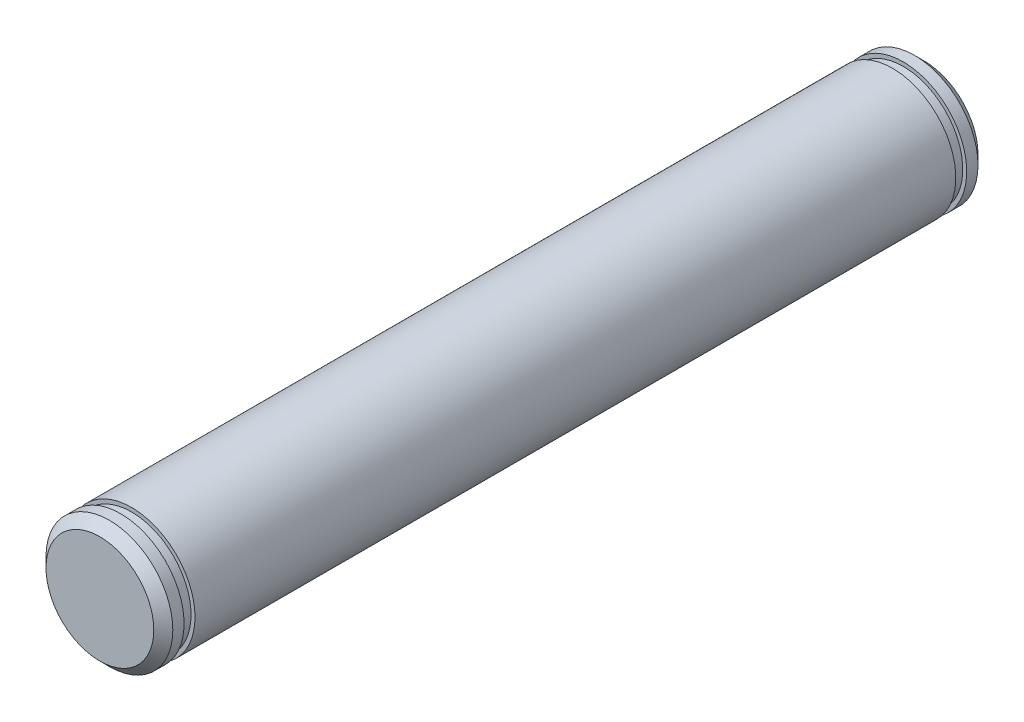
ISO-10303-21;
HEADER;
FILE_DESCRIPTION(('STEP AP214'),'2;1');
FILE_NAME('part.step','',(''),(''),'','','');
FILE_SCHEMA(('AUTOMOTIVE_DESIGN { 1 0 10303 214 1 1 1 1 }'));
ENDSEC;
DATA;
#1=APPLICATION_CONTEXT('core data for automotive mechanical design processes');
#2=APPLICATION_PROTOCOL_DEFINITION('international standard','automotive_design',2000,#1);
#3=PRODUCT_CONTEXT('',#1,'mechanical');
#4=PRODUCT('Part','Part','',(#3));
#5=PRODUCT_RELATED_PRODUCT_CATEGORY('part','',(#4));
#6=PRODUCT_DEFINITION_FORMATION('','',#4);
#7=PRODUCT_DEFINITION_CONTEXT('part definition',#1,'design');
#8=PRODUCT_DEFINITION('design','',#6,#7);
#9=PRODUCT_DEFINITION_SHAPE('','',#8);
#10=(LENGTH_UNIT() NAMED_UNIT(*) SI_UNIT(.MILLI.,.METRE.));
#11=(NAMED_UNIT(*) PLANE_ANGLE_UNIT() SI_UNIT($,.RADIAN.));
#12=(NAMED_UNIT(*) SI_UNIT($,.STERADIAN.) SOLID_ANGLE_UNIT());
#13=UNCERTAINTY_MEASURE_WITH_UNIT(LENGTH_MEASURE(1.E-05),#10,'distance_accuracy_value','');
#14=(GEOMETRIC_REPRESENTATION_CONTEXT(3) GLOBAL_UNCERTAINTY_ASSIGNED_CONTEXT((#13)) GLOBAL_UNIT_ASSIGNED_CONTEXT((#10,
#11,#12)) REPRESENTATION_CONTEXT('',''));
#15=CARTESIAN_POINT('',(0.,0.,0.));
#16=DIRECTION('',(0.,0.,1.));
#17=DIRECTION('',(1.,0.,0.));
#18=AXIS2_PLACEMENT_3D('',#15,#16,#17);
#19=CARTESIAN_POINT('',(0.,0.,165.1));
#20=DIRECTION('',(0.,0.,-1.));
#21=DIRECTION('',(-1.,0.,0.));
#22=AXIS2_PLACEMENT_3D('',#19,#20,#21);
#23=CYLINDRICAL_SURFACE('',#22,12.7);
#24=CARTESIAN_POINT('',(0.,0.,158.75));
#25=DIRECTION('',(0.,0.,-1.));
#26=DIRECTION('',(-1.,0.,0.));
#27=AXIS2_PLACEMENT_3D('',#24,#25,#26);
#28=CIRCLE('',#27,12.7);
#29=CARTESIAN_POINT('',(-12.7,0.,158.75));
#30=VERTEX_POINT('',#29);
#31=EDGE_CURVE('E74',#30,#30,#28,.T.);
#32=ORIENTED_EDGE('',*,*,#31,.T.);
#33=EDGE_LOOP('',(#32));
#34=FACE_BOUND('',#33,.T.);
#35=CARTESIAN_POINT('',(0.,0.,6.35));
#36=DIRECTION('',(0.,0.,-1.));
#37=DIRECTION('',(-1.,0.,0.));
#38=AXIS2_PLACEMENT_3D('',#35,#36,#37);
#39=CIRCLE('',#38,12.7);
#40=CARTESIAN_POINT('',(-12.7,0.,6.35));
#41=VERTEX_POINT('',#40);
#42=EDGE_CURVE('E53',#41,#41,#39,.T.);
#43=ORIENTED_EDGE('',*,*,#42,.F.);
#44=EDGE_LOOP('',(#43));
#45=FACE_BOUND('',#44,.T.);
#46=ADVANCED_FACE('F33',(#34,#45),#23,.T.);
#47=CARTESIAN_POINT('',(-12.7,0.,6.35));
#48=DIRECTION('',(0.,0.,1.));
#49=DIRECTION('',(1.,0.,0.));
#50=AXIS2_PLACEMENT_3D('',#47,#48,#49);
#51=PLANE('',#50);
#52=CARTESIAN_POINT('',(0.,0.,6.35));
#53=DIRECTION('',(0.,0.,-1.));
#54=DIRECTION('',(-1.,0.,0.));
#55=AXIS2_PLACEMENT_3D('',#52,#53,#54);
#56=CIRCLE('',#55,11.9126);
#57=CARTESIAN_POINT('',(-11.9126,0.,6.35));
#58=VERTEX_POINT('',#57);
#59=EDGE_CURVE('E56',#58,#58,#56,.T.);
#60=ORIENTED_EDGE('',*,*,#59,.F.);
#61=EDGE_LOOP('',(#60));
#62=FACE_BOUND('',#61,.T.);
#63=ORIENTED_EDGE('',*,*,#42,.T.);
#64=EDGE_LOOP('',(#63));
#65=FACE_BOUND('',#64,.T.);
#66=ADVANCED_FACE('F114',(#62,#65),#51,.F.);
#67=CARTESIAN_POINT('',(0.,0.,0.));
#68=DIRECTION('',(0.,0.,-1.));
#69=DIRECTION('',(-1.,0.,0.));
#70=AXIS2_PLACEMENT_3D('',#67,#68,#69);
#71=CYLINDRICAL_SURFACE('',#70,11.9126);
#72=CARTESIAN_POINT('',(0.,0.,4.1656));
#73=DIRECTION('',(0.,0.,-1.));
#74=DIRECTION('',(-1.,0.,0.));
#75=AXIS2_PLACEMENT_3D('',#72,#73,#74);
#76=CIRCLE('',#75,11.9126);
#77=CARTESIAN_POINT('',(-11.9126,0.,4.1656));
#78=VERTEX_POINT('',#77);
#79=EDGE_CURVE('E59',#78,#78,#76,.T.);
#80=ORIENTED_EDGE('',*,*,#79,.F.);
#81=EDGE_LOOP('',(#80));
#82=FACE_BOUND('',#81,.T.);
#83=ORIENTED_EDGE('',*,*,#59,.T.);
#84=EDGE_LOOP('',(#83));
#85=FACE_BOUND('',#84,.T.);
#86=ADVANCED_FACE('F126',(#82,#85),#71,.T.);
#87=CARTESIAN_POINT('',(-12.7,0.,4.1656));
#88=DIRECTION('',(0.,0.,-1.));
#89=DIRECTION('',(-1.,0.,0.));
#90=AXIS2_PLACEMENT_3D('',#87,#88,#89);
#91=PLANE('',#90);
#92=CARTESIAN_POINT('',(0.,0.,4.1656));
#93=DIRECTION('',(0.,0.,-1.));
#94=DIRECTION('',(-1.,0.,0.));
#95=AXIS2_PLACEMENT_3D('',#92,#93,#94);
#96=CIRCLE('',#95,12.7);
#97=CARTESIAN_POINT('',(-12.7,0.,4.1656));
#98=VERTEX_POINT('',#97);
#99=EDGE_CURVE('E62',#98,#98,#96,.T.);
#100=ORIENTED_EDGE('',*,*,#99,.F.);
#101=EDGE_LOOP('',(#100));
#102=FACE_BOUND('',#101,.T.);
#103=ORIENTED_EDGE('',*,*,#79,.T.);
#104=EDGE_LOOP('',(#103));
#105=FACE_BOUND('',#104,.T.);
#106=ADVANCED_FACE('F120',(#102,#105),#91,.F.);
#107=CARTESIAN_POINT('',(0.,0.,0.));
#108=DIRECTION('',(0.,0.,1.));
#109=DIRECTION('',(1.,0.,0.));
#110=AXIS2_PLACEMENT_3D('',#107,#108,#109);
#111=PLANE('',#110);
#112=CARTESIAN_POINT('',(0.,0.,0.));
#113=DIRECTION('',(0.,0.,1.));
#114=DIRECTION('',(1.,0.,0.));
#115=AXIS2_PLACEMENT_3D('',#112,#113,#114);
#116=CIRCLE('',#115,10.795);
#117=CARTESIAN_POINT('',(10.795,0.,0.));
#118=VERTEX_POINT('',#117);
#119=EDGE_CURVE('E10',#118,#118,#116,.F.);
#120=ORIENTED_EDGE('',*,*,#119,.T.);
#121=EDGE_LOOP('',(#120));
#122=FACE_BOUND('',#121,.T.);
#123=ADVANCED_FACE('F116',(#122),#111,.F.);
#124=CARTESIAN_POINT('',(0.,0.,1.90500000000002));
#125=DIRECTION('',(0.,0.,1.));
#126=DIRECTION('',(1.,0.,0.));
#127=AXIS2_PLACEMENT_3D('',#124,#125,#126);
#128=CIRCLE('',#127,12.7);
#129=CARTESIAN_POINT('',(12.7,0.,1.90500000000002));
#130=VERTEX_POINT('',#129);
#131=EDGE_CURVE('E40',#130,#130,#128,.T.);
#132=ORIENTED_EDGE('',*,*,#131,.T.);
#133=EDGE_LOOP('',(#132));
#134=FACE_BOUND('',#133,.T.);
#135=ORIENTED_EDGE('',*,*,#99,.T.);
#136=EDGE_LOOP('',(#135));
#137=FACE_BOUND('',#136,.T.);
#138=ADVANCED_FACE('F96',(#134,#137),#23,.T.);
#139=CARTESIAN_POINT('',(-12.7,0.,160.9344));
#140=DIRECTION('',(0.,0.,1.));
#141=DIRECTION('',(1.,0.,0.));
#142=AXIS2_PLACEMENT_3D('',#139,#140,#141);
#143=PLANE('',#142);
#144=CARTESIAN_POINT('',(0.,0.,160.9344));
#145=DIRECTION('',(0.,0.,-1.));
#146=DIRECTION('',(-1.,0.,0.));
#147=AXIS2_PLACEMENT_3D('',#144,#145,#146);
#148=CIRCLE('',#147,11.9126);
#149=CARTESIAN_POINT('',(-11.9126,0.,160.9344));
#150=VERTEX_POINT('',#149);
#151=EDGE_CURVE('E68',#150,#150,#148,.T.);
#152=ORIENTED_EDGE('',*,*,#151,.F.);
#153=EDGE_LOOP('',(#152));
#154=FACE_BOUND('',#153,.T.);
#155=CARTESIAN_POINT('',(0.,0.,160.9344));
#156=DIRECTION('',(0.,0.,-1.));
#157=DIRECTION('',(-1.,0.,0.));
#158=AXIS2_PLACEMENT_3D('',#155,#156,#157);
#159=CIRCLE('',#158,12.7);
#160=CARTESIAN_POINT('',(-12.7,0.,160.9344));
#161=VERTEX_POINT('',#160);
#162=EDGE_CURVE('E65',#161,#161,#159,.T.);
#163=ORIENTED_EDGE('',*,*,#162,.T.);
#164=EDGE_LOOP('',(#163));
#165=FACE_BOUND('',#164,.T.);
#166=ADVANCED_FACE('F90',(#154,#165),#143,.F.);
#167=CARTESIAN_POINT('',(0.,0.,0.));
#168=DIRECTION('',(0.,0.,-1.));
#169=DIRECTION('',(-1.,0.,0.));
#170=AXIS2_PLACEMENT_3D('',#167,#168,#169);
#171=CYLINDRICAL_SURFACE('',#170,11.9126);
#172=CARTESIAN_POINT('',(0.,0.,158.75));
#173=DIRECTION('',(0.,0.,-1.));
#174=DIRECTION('',(-1.,0.,0.));
#175=AXIS2_PLACEMENT_3D('',#172,#173,#174);
#176=CIRCLE('',#175,11.9126);
#177=CARTESIAN_POINT('',(-11.9126,0.,158.75));
#178=VERTEX_POINT('',#177);
#179=EDGE_CURVE('E71',#178,#178,#176,.T.);
#180=ORIENTED_EDGE('',*,*,#179,.F.);
#181=EDGE_LOOP('',(#180));
#182=FACE_BOUND('',#181,.T.);
#183=ORIENTED_EDGE('',*,*,#151,.T.);
#184=EDGE_LOOP('',(#183));
#185=FACE_BOUND('',#184,.T.);
#186=ADVANCED_FACE('F84',(#182,#185),#171,.T.);
#187=CARTESIAN_POINT('',(-12.7,0.,158.75));
#188=DIRECTION('',(0.,0.,-1.));
#189=DIRECTION('',(-1.,0.,0.));
#190=AXIS2_PLACEMENT_3D('',#187,#188,#189);
#191=PLANE('',#190);
#192=ORIENTED_EDGE('',*,*,#31,.F.);
#193=EDGE_LOOP('',(#192));
#194=FACE_BOUND('',#193,.T.);
#195=ORIENTED_EDGE('',*,*,#179,.T.);
#196=EDGE_LOOP('',(#195));
#197=FACE_BOUND('',#196,.T.);
#198=ADVANCED_FACE('F80',(#194,#197),#191,.F.);
#199=CARTESIAN_POINT('',(0.,0.,165.1));
#200=DIRECTION('',(0.,0.,1.));
#201=DIRECTION('',(1.,0.,0.));
#202=AXIS2_PLACEMENT_3D('',#199,#200,#201);
#203=PLANE('',#202);
#204=CARTESIAN_POINT('',(0.,0.,165.1));
#205=DIRECTION('',(0.,0.,1.));
#206=DIRECTION('',(1.,0.,0.));
#207=AXIS2_PLACEMENT_3D('',#204,#205,#206);
#208=CIRCLE('',#207,10.795);
#209=CARTESIAN_POINT('',(10.795,0.,165.1));
#210=VERTEX_POINT('',#209);
#211=EDGE_CURVE('E48',#210,#210,#208,.T.);
#212=ORIENTED_EDGE('',*,*,#211,.T.);
#213=EDGE_LOOP('',(#212));
#214=FACE_BOUND('',#213,.T.);
#215=ADVANCED_FACE('F83',(#214),#203,.T.);
#216=CARTESIAN_POINT('',(0.,0.,163.195));
#217=DIRECTION('',(0.,0.,1.));
#218=DIRECTION('',(1.,0.,0.));
#219=AXIS2_PLACEMENT_3D('',#216,#217,#218);
#220=CIRCLE('',#219,12.7);
#221=CARTESIAN_POINT('',(12.7,0.,163.195));
#222=VERTEX_POINT('',#221);
#223=EDGE_CURVE('E44',#222,#222,#220,.F.);
#224=ORIENTED_EDGE('',*,*,#223,.T.);
#225=EDGE_LOOP('',(#224));
#226=FACE_BOUND('',#225,.T.);
#227=ORIENTED_EDGE('',*,*,#162,.F.);
#228=EDGE_LOOP('',(#227));
#229=FACE_BOUND('',#228,.T.);
#230=ADVANCED_FACE('F100',(#226,#229),#23,.T.);
#231=CARTESIAN_POINT('',(0.,0.,165.1));
#232=DIRECTION('',(0.,0.,-1.));
#233=DIRECTION('',(-1.,0.,0.));
#234=AXIS2_PLACEMENT_3D('',#231,#232,#233);
#235=CONICAL_SURFACE('',#234,10.795,0.785398163397447);
#236=ORIENTED_EDGE('',*,*,#223,.F.);
#237=EDGE_LOOP('',(#236));
#238=FACE_BOUND('',#237,.T.);
#239=ORIENTED_EDGE('',*,*,#211,.F.);
#240=EDGE_LOOP('',(#239));
#241=FACE_BOUND('',#240,.T.);
#242=ADVANCED_FACE('F102',(#238,#241),#235,.T.);
#243=CARTESIAN_POINT('',(0.,0.,1.90500000000002));
#244=DIRECTION('',(0.,0.,1.));
#245=DIRECTION('',(1.,0.,0.));
#246=AXIS2_PLACEMENT_3D('',#243,#244,#245);
#247=CONICAL_SURFACE('',#246,12.7,0.785398163397451);
#248=ORIENTED_EDGE('',*,*,#119,.F.);
#249=EDGE_LOOP('',(#248));
#250=FACE_BOUND('',#249,.T.);
#251=ORIENTED_EDGE('',*,*,#131,.F.);
#252=EDGE_LOOP('',(#251));
#253=FACE_BOUND('',#252,.T.);
#254=ADVANCED_FACE('F35',(#250,#253),#247,.T.);
#255=CLOSED_SHELL('',(#46,#66,#86,#106,#123,#138,#166,#186,#198,#215,#230,#242,#254));
#256=MANIFOLD_SOLID_BREP('B2',#255);
#257=ADVANCED_BREP_SHAPE_REPRESENTATION('',(#18,#256),#14);
#258=SHAPE_DEFINITION_REPRESENTATION(#9,#257);
ENDSEC;
END-ISO-10303-21;
